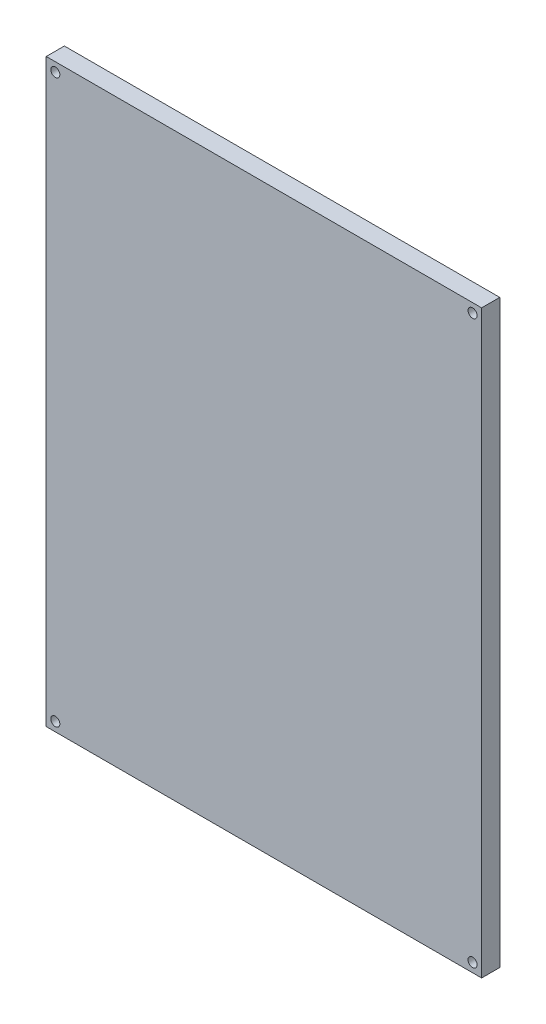
ISO-10303-21;
HEADER;
FILE_DESCRIPTION(('STEP AP214'),'2;1');
FILE_NAME('part.step','',(''),(''),'','','');
FILE_SCHEMA(('AUTOMOTIVE_DESIGN { 1 0 10303 214 1 1 1 1 }'));
ENDSEC;
DATA;
#1=APPLICATION_CONTEXT('core data for automotive mechanical design processes');
#2=APPLICATION_PROTOCOL_DEFINITION('international standard','automotive_design',2000,#1);
#3=PRODUCT_CONTEXT('',#1,'mechanical');
#4=PRODUCT('Part','Part','',(#3));
#5=PRODUCT_RELATED_PRODUCT_CATEGORY('part','',(#4));
#6=PRODUCT_DEFINITION_FORMATION('','',#4);
#7=PRODUCT_DEFINITION_CONTEXT('part definition',#1,'design');
#8=PRODUCT_DEFINITION('design','',#6,#7);
#9=PRODUCT_DEFINITION_SHAPE('','',#8);
#10=(LENGTH_UNIT() NAMED_UNIT(*) SI_UNIT(.MILLI.,.METRE.));
#11=(NAMED_UNIT(*) PLANE_ANGLE_UNIT() SI_UNIT($,.RADIAN.));
#12=(NAMED_UNIT(*) SI_UNIT($,.STERADIAN.) SOLID_ANGLE_UNIT());
#13=UNCERTAINTY_MEASURE_WITH_UNIT(LENGTH_MEASURE(1.E-05),#10,'distance_accuracy_value','');
#14=(GEOMETRIC_REPRESENTATION_CONTEXT(3) GLOBAL_UNCERTAINTY_ASSIGNED_CONTEXT((#13)) GLOBAL_UNIT_ASSIGNED_CONTEXT((#10,
#11,#12)) REPRESENTATION_CONTEXT('',''));
#15=CARTESIAN_POINT('',(0.,0.,0.));
#16=DIRECTION('',(0.,0.,1.));
#17=DIRECTION('',(1.,0.,0.));
#18=AXIS2_PLACEMENT_3D('',#15,#16,#17);
#19=CARTESIAN_POINT('',(0.,0.,10.));
#20=DIRECTION('',(0.,0.,-1.));
#21=DIRECTION('',(-1.,0.,0.));
#22=AXIS2_PLACEMENT_3D('',#19,#20,#21);
#23=PLANE('',#22);
#24=DIRECTION('',(0.,-1.,0.));
#25=VECTOR('',#24,1.);
#26=CARTESIAN_POINT('',(-120.075,-160.065,10.));
#27=LINE('',#26,#25);
#28=CARTESIAN_POINT('',(-120.075,160.065,10.));
#29=VERTEX_POINT('',#28);
#30=CARTESIAN_POINT('',(-120.075,-160.065,10.));
#31=VERTEX_POINT('',#30);
#32=EDGE_CURVE('E95',#29,#31,#27,.T.);
#33=ORIENTED_EDGE('',*,*,#32,.T.);
#34=DIRECTION('',(1.,0.,0.));
#35=VECTOR('',#34,1.);
#36=CARTESIAN_POINT('',(120.075,-160.065,10.));
#37=LINE('',#36,#35);
#38=CARTESIAN_POINT('',(120.075,-160.065,10.));
#39=VERTEX_POINT('',#38);
#40=EDGE_CURVE('E90',#31,#39,#37,.T.);
#41=ORIENTED_EDGE('',*,*,#40,.T.);
#42=DIRECTION('',(0.,1.,0.));
#43=VECTOR('',#42,1.);
#44=CARTESIAN_POINT('',(120.075,160.065,10.));
#45=LINE('',#44,#43);
#46=CARTESIAN_POINT('',(120.075,160.065,10.));
#47=VERTEX_POINT('',#46);
#48=EDGE_CURVE('E93',#39,#47,#45,.T.);
#49=ORIENTED_EDGE('',*,*,#48,.T.);
#50=DIRECTION('',(-1.,0.,0.));
#51=VECTOR('',#50,1.);
#52=CARTESIAN_POINT('',(-120.075,160.065,10.));
#53=LINE('',#52,#51);
#54=EDGE_CURVE('E60',#47,#29,#53,.T.);
#55=ORIENTED_EDGE('',*,*,#54,.T.);
#56=EDGE_LOOP('',(#33,#41,#49,#55));
#57=FACE_BOUND('',#56,.T.);
#58=CARTESIAN_POINT('',(-115.075,155.065,10.));
#59=DIRECTION('',(0.,0.,1.));
#60=DIRECTION('',(1.,0.,0.));
#61=AXIS2_PLACEMENT_3D('',#58,#59,#60);
#62=CIRCLE('',#61,2.50000000000001);
#63=CARTESIAN_POINT('',(-112.575,155.065,10.));
#64=VERTEX_POINT('',#63);
#65=EDGE_CURVE('E110',#64,#64,#62,.T.);
#66=ORIENTED_EDGE('',*,*,#65,.F.);
#67=EDGE_LOOP('',(#66));
#68=FACE_BOUND('',#67,.T.);
#69=CARTESIAN_POINT('',(115.075,155.065,10.));
#70=DIRECTION('',(0.,0.,1.));
#71=DIRECTION('',(1.,0.,0.));
#72=AXIS2_PLACEMENT_3D('',#69,#70,#71);
#73=CIRCLE('',#72,2.5);
#74=CARTESIAN_POINT('',(117.575,155.065,10.));
#75=VERTEX_POINT('',#74);
#76=EDGE_CURVE('E125',#75,#75,#73,.T.);
#77=ORIENTED_EDGE('',*,*,#76,.F.);
#78=EDGE_LOOP('',(#77));
#79=FACE_BOUND('',#78,.T.);
#80=CARTESIAN_POINT('',(-115.075,-155.065,10.));
#81=DIRECTION('',(0.,0.,1.));
#82=DIRECTION('',(1.,0.,0.));
#83=AXIS2_PLACEMENT_3D('',#80,#81,#82);
#84=CIRCLE('',#83,2.50000000000001);
#85=CARTESIAN_POINT('',(-112.575,-155.065,10.));
#86=VERTEX_POINT('',#85);
#87=EDGE_CURVE('E131',#86,#86,#84,.T.);
#88=ORIENTED_EDGE('',*,*,#87,.F.);
#89=EDGE_LOOP('',(#88));
#90=FACE_BOUND('',#89,.T.);
#91=CARTESIAN_POINT('',(115.075,-155.065,10.));
#92=DIRECTION('',(0.,0.,1.));
#93=DIRECTION('',(1.,0.,0.));
#94=AXIS2_PLACEMENT_3D('',#91,#92,#93);
#95=CIRCLE('',#94,2.50000000000001);
#96=CARTESIAN_POINT('',(117.575,-155.065,10.));
#97=VERTEX_POINT('',#96);
#98=EDGE_CURVE('E137',#97,#97,#95,.T.);
#99=ORIENTED_EDGE('',*,*,#98,.F.);
#100=EDGE_LOOP('',(#99));
#101=FACE_BOUND('',#100,.T.);
#102=ADVANCED_FACE('F43',(#57,#68,#79,#90,#101),#23,.F.);
#103=CARTESIAN_POINT('',(0.,0.,0.));
#104=DIRECTION('',(0.,0.,-1.));
#105=DIRECTION('',(-1.,0.,0.));
#106=AXIS2_PLACEMENT_3D('',#103,#104,#105);
#107=PLANE('',#106);
#108=CARTESIAN_POINT('',(-115.075,-155.065,0.));
#109=DIRECTION('',(0.,0.,1.));
#110=DIRECTION('',(1.,0.,0.));
#111=AXIS2_PLACEMENT_3D('',#108,#109,#110);
#112=CIRCLE('',#111,2.50000000000001);
#113=CARTESIAN_POINT('',(-112.575,-155.065,0.));
#114=VERTEX_POINT('',#113);
#115=EDGE_CURVE('E134',#114,#114,#112,.T.);
#116=ORIENTED_EDGE('',*,*,#115,.T.);
#117=EDGE_LOOP('',(#116));
#118=FACE_BOUND('',#117,.T.);
#119=CARTESIAN_POINT('',(-115.075,155.065,0.));
#120=DIRECTION('',(0.,0.,1.));
#121=DIRECTION('',(1.,0.,0.));
#122=AXIS2_PLACEMENT_3D('',#119,#120,#121);
#123=CIRCLE('',#122,2.50000000000001);
#124=CARTESIAN_POINT('',(-112.575,155.065,0.));
#125=VERTEX_POINT('',#124);
#126=EDGE_CURVE('E122',#125,#125,#123,.T.);
#127=ORIENTED_EDGE('',*,*,#126,.T.);
#128=EDGE_LOOP('',(#127));
#129=FACE_BOUND('',#128,.T.);
#130=DIRECTION('',(0.,-1.,0.));
#131=VECTOR('',#130,1.);
#132=CARTESIAN_POINT('',(-120.075,-160.065,0.));
#133=LINE('',#132,#131);
#134=CARTESIAN_POINT('',(-120.075,160.065,0.));
#135=VERTEX_POINT('',#134);
#136=CARTESIAN_POINT('',(-120.075,-160.065,0.));
#137=VERTEX_POINT('',#136);
#138=EDGE_CURVE('E107',#135,#137,#133,.T.);
#139=ORIENTED_EDGE('',*,*,#138,.F.);
#140=DIRECTION('',(-1.,0.,0.));
#141=VECTOR('',#140,1.);
#142=CARTESIAN_POINT('',(-120.075,160.065,0.));
#143=LINE('',#142,#141);
#144=CARTESIAN_POINT('',(120.075,160.065,0.));
#145=VERTEX_POINT('',#144);
#146=EDGE_CURVE('E83',#145,#135,#143,.T.);
#147=ORIENTED_EDGE('',*,*,#146,.F.);
#148=DIRECTION('',(0.,1.,0.));
#149=VECTOR('',#148,1.);
#150=CARTESIAN_POINT('',(120.075,160.065,0.));
#151=LINE('',#150,#149);
#152=CARTESIAN_POINT('',(120.075,-160.065,0.));
#153=VERTEX_POINT('',#152);
#154=EDGE_CURVE('E77',#153,#145,#151,.T.);
#155=ORIENTED_EDGE('',*,*,#154,.F.);
#156=DIRECTION('',(1.,0.,0.));
#157=VECTOR('',#156,1.);
#158=CARTESIAN_POINT('',(120.075,-160.065,0.));
#159=LINE('',#158,#157);
#160=EDGE_CURVE('E99',#137,#153,#159,.T.);
#161=ORIENTED_EDGE('',*,*,#160,.F.);
#162=EDGE_LOOP('',(#139,#147,#155,#161));
#163=FACE_BOUND('',#162,.T.);
#164=CARTESIAN_POINT('',(115.075,155.065,0.));
#165=DIRECTION('',(0.,0.,1.));
#166=DIRECTION('',(1.,0.,0.));
#167=AXIS2_PLACEMENT_3D('',#164,#165,#166);
#168=CIRCLE('',#167,2.5);
#169=CARTESIAN_POINT('',(117.575,155.065,0.));
#170=VERTEX_POINT('',#169);
#171=EDGE_CURVE('E128',#170,#170,#168,.T.);
#172=ORIENTED_EDGE('',*,*,#171,.T.);
#173=EDGE_LOOP('',(#172));
#174=FACE_BOUND('',#173,.T.);
#175=CARTESIAN_POINT('',(115.075,-155.065,0.));
#176=DIRECTION('',(0.,0.,1.));
#177=DIRECTION('',(1.,0.,0.));
#178=AXIS2_PLACEMENT_3D('',#175,#176,#177);
#179=CIRCLE('',#178,2.50000000000001);
#180=CARTESIAN_POINT('',(117.575,-155.065,0.));
#181=VERTEX_POINT('',#180);
#182=EDGE_CURVE('E140',#181,#181,#179,.T.);
#183=ORIENTED_EDGE('',*,*,#182,.T.);
#184=EDGE_LOOP('',(#183));
#185=FACE_BOUND('',#184,.T.);
#186=ADVANCED_FACE('F118',(#118,#129,#163,#174,#185),#107,.T.);
#187=CARTESIAN_POINT('',(-120.075,-160.065,10.));
#188=DIRECTION('',(1.,0.,0.));
#189=DIRECTION('',(0.,0.,-1.));
#190=AXIS2_PLACEMENT_3D('',#187,#188,#189);
#191=PLANE('',#190);
#192=ORIENTED_EDGE('',*,*,#138,.T.);
#193=DIRECTION('',(0.,0.,-1.));
#194=VECTOR('',#193,1.);
#195=CARTESIAN_POINT('',(-120.075,-160.065,10.));
#196=LINE('',#195,#194);
#197=EDGE_CURVE('E11',#31,#137,#196,.T.);
#198=ORIENTED_EDGE('',*,*,#197,.F.);
#199=ORIENTED_EDGE('',*,*,#32,.F.);
#200=DIRECTION('',(0.,0.,-1.));
#201=VECTOR('',#200,1.);
#202=CARTESIAN_POINT('',(-120.075,160.065,10.));
#203=LINE('',#202,#201);
#204=EDGE_CURVE('E103',#29,#135,#203,.T.);
#205=ORIENTED_EDGE('',*,*,#204,.T.);
#206=EDGE_LOOP('',(#192,#198,#199,#205));
#207=FACE_BOUND('',#206,.T.);
#208=ADVANCED_FACE('F45',(#207),#191,.F.);
#209=CARTESIAN_POINT('',(120.075,-160.065,10.));
#210=DIRECTION('',(0.,1.,0.));
#211=DIRECTION('',(0.,0.,1.));
#212=AXIS2_PLACEMENT_3D('',#209,#210,#211);
#213=PLANE('',#212);
#214=ORIENTED_EDGE('',*,*,#160,.T.);
#215=DIRECTION('',(0.,0.,-1.));
#216=VECTOR('',#215,1.);
#217=CARTESIAN_POINT('',(120.075,-160.065,10.));
#218=LINE('',#217,#216);
#219=EDGE_CURVE('E52',#39,#153,#218,.T.);
#220=ORIENTED_EDGE('',*,*,#219,.F.);
#221=ORIENTED_EDGE('',*,*,#40,.F.);
#222=ORIENTED_EDGE('',*,*,#197,.T.);
#223=EDGE_LOOP('',(#214,#220,#221,#222));
#224=FACE_BOUND('',#223,.T.);
#225=ADVANCED_FACE('F98',(#224),#213,.F.);
#226=CARTESIAN_POINT('',(120.075,160.065,10.));
#227=DIRECTION('',(-1.,0.,0.));
#228=DIRECTION('',(0.,0.,1.));
#229=AXIS2_PLACEMENT_3D('',#226,#227,#228);
#230=PLANE('',#229);
#231=ORIENTED_EDGE('',*,*,#154,.T.);
#232=DIRECTION('',(0.,0.,-1.));
#233=VECTOR('',#232,1.);
#234=CARTESIAN_POINT('',(120.075,160.065,10.));
#235=LINE('',#234,#233);
#236=EDGE_CURVE('E100',#47,#145,#235,.T.);
#237=ORIENTED_EDGE('',*,*,#236,.F.);
#238=ORIENTED_EDGE('',*,*,#48,.F.);
#239=ORIENTED_EDGE('',*,*,#219,.T.);
#240=EDGE_LOOP('',(#231,#237,#238,#239));
#241=FACE_BOUND('',#240,.T.);
#242=ADVANCED_FACE('F101',(#241),#230,.F.);
#243=CARTESIAN_POINT('',(-120.075,160.065,10.));
#244=DIRECTION('',(0.,-1.,0.));
#245=DIRECTION('',(0.,0.,-1.));
#246=AXIS2_PLACEMENT_3D('',#243,#244,#245);
#247=PLANE('',#246);
#248=ORIENTED_EDGE('',*,*,#146,.T.);
#249=ORIENTED_EDGE('',*,*,#204,.F.);
#250=ORIENTED_EDGE('',*,*,#54,.F.);
#251=ORIENTED_EDGE('',*,*,#236,.T.);
#252=EDGE_LOOP('',(#248,#249,#250,#251));
#253=FACE_BOUND('',#252,.T.);
#254=ADVANCED_FACE('F115',(#253),#247,.F.);
#255=CARTESIAN_POINT('',(-115.075,155.065,10.));
#256=DIRECTION('',(0.,0.,-1.));
#257=DIRECTION('',(-1.,0.,0.));
#258=AXIS2_PLACEMENT_3D('',#255,#256,#257);
#259=CYLINDRICAL_SURFACE('',#258,2.50000000000001);
#260=ORIENTED_EDGE('',*,*,#65,.T.);
#261=EDGE_LOOP('',(#260));
#262=FACE_BOUND('',#261,.T.);
#263=ORIENTED_EDGE('',*,*,#126,.F.);
#264=EDGE_LOOP('',(#263));
#265=FACE_BOUND('',#264,.T.);
#266=ADVANCED_FACE('F157',(#262,#265),#259,.F.);
#267=CARTESIAN_POINT('',(115.075,155.065,10.));
#268=DIRECTION('',(0.,0.,-1.));
#269=DIRECTION('',(-1.,0.,0.));
#270=AXIS2_PLACEMENT_3D('',#267,#268,#269);
#271=CYLINDRICAL_SURFACE('',#270,2.5);
#272=ORIENTED_EDGE('',*,*,#76,.T.);
#273=EDGE_LOOP('',(#272));
#274=FACE_BOUND('',#273,.T.);
#275=ORIENTED_EDGE('',*,*,#171,.F.);
#276=EDGE_LOOP('',(#275));
#277=FACE_BOUND('',#276,.T.);
#278=ADVANCED_FACE('F202',(#274,#277),#271,.F.);
#279=CARTESIAN_POINT('',(-115.075,-155.065,10.));
#280=DIRECTION('',(0.,0.,-1.));
#281=DIRECTION('',(-1.,0.,0.));
#282=AXIS2_PLACEMENT_3D('',#279,#280,#281);
#283=CYLINDRICAL_SURFACE('',#282,2.50000000000001);
#284=ORIENTED_EDGE('',*,*,#87,.T.);
#285=EDGE_LOOP('',(#284));
#286=FACE_BOUND('',#285,.T.);
#287=ORIENTED_EDGE('',*,*,#115,.F.);
#288=EDGE_LOOP('',(#287));
#289=FACE_BOUND('',#288,.T.);
#290=ADVANCED_FACE('F210',(#286,#289),#283,.F.);
#291=CARTESIAN_POINT('',(115.075,-155.065,10.));
#292=DIRECTION('',(0.,0.,-1.));
#293=DIRECTION('',(-1.,0.,0.));
#294=AXIS2_PLACEMENT_3D('',#291,#292,#293);
#295=CYLINDRICAL_SURFACE('',#294,2.50000000000001);
#296=ORIENTED_EDGE('',*,*,#98,.T.);
#297=EDGE_LOOP('',(#296));
#298=FACE_BOUND('',#297,.T.);
#299=ORIENTED_EDGE('',*,*,#182,.F.);
#300=EDGE_LOOP('',(#299));
#301=FACE_BOUND('',#300,.T.);
#302=ADVANCED_FACE('F146',(#298,#301),#295,.F.);
#303=CLOSED_SHELL('',(#102,#186,#208,#225,#242,#254,#266,#278,#290,#302));
#304=MANIFOLD_SOLID_BREP('B2',#303);
#305=ADVANCED_BREP_SHAPE_REPRESENTATION('',(#18,#304),#14);
#306=SHAPE_DEFINITION_REPRESENTATION(#9,#305);
ENDSEC;
END-ISO-10303-21;
